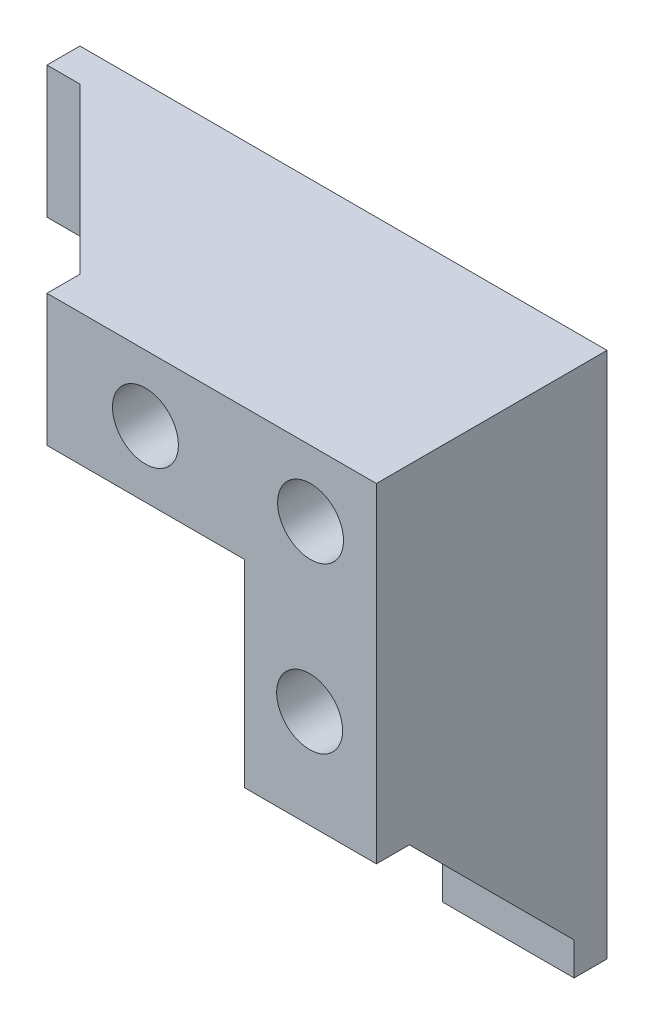
ISO-10303-21;
HEADER;
FILE_DESCRIPTION(('STEP AP214'),'2;1');
FILE_NAME('part.step','',(''),(''),'','','');
FILE_SCHEMA(('AUTOMOTIVE_DESIGN { 1 0 10303 214 1 1 1 1 }'));
ENDSEC;
DATA;
#1=APPLICATION_CONTEXT('core data for automotive mechanical design processes');
#2=APPLICATION_PROTOCOL_DEFINITION('international standard','automotive_design',2000,#1);
#3=PRODUCT_CONTEXT('',#1,'mechanical');
#4=PRODUCT('Part','Part','',(#3));
#5=PRODUCT_RELATED_PRODUCT_CATEGORY('part','',(#4));
#6=PRODUCT_DEFINITION_FORMATION('','',#4);
#7=PRODUCT_DEFINITION_CONTEXT('part definition',#1,'design');
#8=PRODUCT_DEFINITION('design','',#6,#7);
#9=PRODUCT_DEFINITION_SHAPE('','',#8);
#10=(LENGTH_UNIT() NAMED_UNIT(*) SI_UNIT(.MILLI.,.METRE.));
#11=(NAMED_UNIT(*) PLANE_ANGLE_UNIT() SI_UNIT($,.RADIAN.));
#12=(NAMED_UNIT(*) SI_UNIT($,.STERADIAN.) SOLID_ANGLE_UNIT());
#13=UNCERTAINTY_MEASURE_WITH_UNIT(LENGTH_MEASURE(1.E-05),#10,'distance_accuracy_value','');
#14=(GEOMETRIC_REPRESENTATION_CONTEXT(3) GLOBAL_UNCERTAINTY_ASSIGNED_CONTEXT((#13)) GLOBAL_UNIT_ASSIGNED_CONTEXT((#10,
#11,#12)) REPRESENTATION_CONTEXT('',''));
#15=CARTESIAN_POINT('',(0.,0.,0.));
#16=DIRECTION('',(0.,0.,1.));
#17=DIRECTION('',(1.,0.,0.));
#18=AXIS2_PLACEMENT_3D('',#15,#16,#17);
#19=CARTESIAN_POINT('',(29.3793103448276,-37.0344827586207,35.));
#20=DIRECTION('',(1.,0.,0.));
#21=DIRECTION('',(0.,1.,0.));
#22=AXIS2_PLACEMENT_3D('',#19,#20,#21);
#23=PLANE('',#22);
#24=DIRECTION('',(0.,-1.,0.));
#25=VECTOR('',#24,1.);
#26=CARTESIAN_POINT('',(29.3793103448276,-37.0344827586207,4.99999999999999));
#27=LINE('',#26,#25);
#28=CARTESIAN_POINT('',(29.3793103448276,-32.0344827586207,4.99999999999999));
#29=VERTEX_POINT('',#28);
#30=CARTESIAN_POINT('',(29.3793103448276,-37.0344827586207,5.));
#31=VERTEX_POINT('',#30);
#32=EDGE_CURVE('E181',#29,#31,#27,.T.);
#33=ORIENTED_EDGE('',*,*,#32,.F.);
#34=DIRECTION('',(0.,0.707106781186547,0.707106781186548));
#35=VECTOR('',#34,1.);
#36=CARTESIAN_POINT('',(29.3793103448276,-19.5344827586207,17.5));
#37=LINE('',#36,#35);
#38=CARTESIAN_POINT('',(29.3793103448276,-7.0344827586207,30.));
#39=VERTEX_POINT('',#38);
#40=EDGE_CURVE('E175',#29,#39,#37,.T.);
#41=ORIENTED_EDGE('',*,*,#40,.T.);
#42=DIRECTION('',(0.,0.,1.));
#43=VECTOR('',#42,1.);
#44=CARTESIAN_POINT('',(29.3793103448276,-7.0344827586207,35.));
#45=LINE('',#44,#43);
#46=CARTESIAN_POINT('',(29.3793103448276,-7.0344827586207,35.));
#47=VERTEX_POINT('',#46);
#48=EDGE_CURVE('E178',#39,#47,#45,.T.);
#49=ORIENTED_EDGE('',*,*,#48,.T.);
#50=DIRECTION('',(0.,-1.,0.));
#51=VECTOR('',#50,1.);
#52=CARTESIAN_POINT('',(29.3793103448276,-37.0344827586207,35.));
#53=LINE('',#52,#51);
#54=CARTESIAN_POINT('',(29.3793103448276,22.9655172413793,35.));
#55=VERTEX_POINT('',#54);
#56=EDGE_CURVE('E240',#55,#47,#53,.T.);
#57=ORIENTED_EDGE('',*,*,#56,.F.);
#58=DIRECTION('',(0.,0.,-1.));
#59=VECTOR('',#58,1.);
#60=CARTESIAN_POINT('',(29.3793103448276,22.9655172413793,35.));
#61=LINE('',#60,#59);
#62=CARTESIAN_POINT('',(29.3793103448276,22.9655172413793,0.));
#63=VERTEX_POINT('',#62);
#64=EDGE_CURVE('E43',#55,#63,#61,.T.);
#65=ORIENTED_EDGE('',*,*,#64,.T.);
#66=DIRECTION('',(0.,-1.,0.));
#67=VECTOR('',#66,1.);
#68=CARTESIAN_POINT('',(29.3793103448276,-37.0344827586207,0.));
#69=LINE('',#68,#67);
#70=CARTESIAN_POINT('',(29.3793103448276,-37.0344827586207,0.));
#71=VERTEX_POINT('',#70);
#72=EDGE_CURVE('E253',#63,#71,#69,.T.);
#73=ORIENTED_EDGE('',*,*,#72,.T.);
#74=DIRECTION('',(0.,0.,-1.));
#75=VECTOR('',#74,1.);
#76=CARTESIAN_POINT('',(29.3793103448276,-37.0344827586207,35.));
#77=LINE('',#76,#75);
#78=EDGE_CURVE('E269',#31,#71,#77,.T.);
#79=ORIENTED_EDGE('',*,*,#78,.F.);
#80=EDGE_LOOP('',(#33,#41,#49,#57,#65,#73,#79));
#81=FACE_BOUND('',#80,.T.);
#82=ADVANCED_FACE('F34',(#81),#23,.F.);
#83=CARTESIAN_POINT('',(49.3793103448276,-37.0344827586207,35.));
#84=DIRECTION('',(0.,1.,0.));
#85=DIRECTION('',(0.,0.,1.));
#86=AXIS2_PLACEMENT_3D('',#83,#84,#85);
#87=PLANE('',#86);
#88=DIRECTION('',(1.,0.,0.));
#89=VECTOR('',#88,1.);
#90=CARTESIAN_POINT('',(14.3793103448276,-37.0344827586207,5.));
#91=LINE('',#90,#89);
#92=CARTESIAN_POINT('',(49.3793103448276,-37.0344827586207,5.));
#93=VERTEX_POINT('',#92);
#94=EDGE_CURVE('E167',#31,#93,#91,.T.);
#95=ORIENTED_EDGE('',*,*,#94,.F.);
#96=ORIENTED_EDGE('',*,*,#78,.T.);
#97=DIRECTION('',(1.,0.,0.));
#98=VECTOR('',#97,1.);
#99=CARTESIAN_POINT('',(49.3793103448276,-37.0344827586207,0.));
#100=LINE('',#99,#98);
#101=CARTESIAN_POINT('',(49.3793103448276,-37.0344827586207,0.));
#102=VERTEX_POINT('',#101);
#103=EDGE_CURVE('E256',#71,#102,#100,.T.);
#104=ORIENTED_EDGE('',*,*,#103,.T.);
#105=DIRECTION('',(0.,0.,-1.));
#106=VECTOR('',#105,1.);
#107=CARTESIAN_POINT('',(49.3793103448276,-37.0344827586207,35.));
#108=LINE('',#107,#106);
#109=EDGE_CURVE('E267',#93,#102,#108,.T.);
#110=ORIENTED_EDGE('',*,*,#109,.F.);
#111=EDGE_LOOP('',(#95,#96,#104,#110));
#112=FACE_BOUND('',#111,.T.);
#113=ADVANCED_FACE('F303',(#112),#87,.F.);
#114=CARTESIAN_POINT('',(49.3793103448276,42.9655172413793,35.));
#115=DIRECTION('',(-1.,0.,0.));
#116=DIRECTION('',(0.,0.,1.));
#117=AXIS2_PLACEMENT_3D('',#114,#115,#116);
#118=PLANE('',#117);
#119=DIRECTION('',(0.,-1.,0.));
#120=VECTOR('',#119,1.);
#121=CARTESIAN_POINT('',(49.3793103448276,0.,5.));
#122=LINE('',#121,#120);
#123=CARTESIAN_POINT('',(49.3793103448276,-32.0344827586207,4.99999999999999));
#124=VERTEX_POINT('',#123);
#125=EDGE_CURVE('E159',#124,#93,#122,.T.);
#126=ORIENTED_EDGE('',*,*,#125,.T.);
#127=ORIENTED_EDGE('',*,*,#109,.T.);
#128=DIRECTION('',(0.,1.,0.));
#129=VECTOR('',#128,1.);
#130=CARTESIAN_POINT('',(49.3793103448276,42.9655172413793,0.));
#131=LINE('',#130,#129);
#132=CARTESIAN_POINT('',(49.3793103448276,42.9655172413793,0.));
#133=VERTEX_POINT('',#132);
#134=EDGE_CURVE('E259',#102,#133,#131,.T.);
#135=ORIENTED_EDGE('',*,*,#134,.T.);
#136=DIRECTION('',(0.,0.,-1.));
#137=VECTOR('',#136,1.);
#138=CARTESIAN_POINT('',(49.3793103448276,42.9655172413793,35.));
#139=LINE('',#138,#137);
#140=CARTESIAN_POINT('',(49.3793103448276,42.9655172413793,35.));
#141=VERTEX_POINT('',#140);
#142=EDGE_CURVE('E264',#141,#133,#139,.T.);
#143=ORIENTED_EDGE('',*,*,#142,.F.);
#144=DIRECTION('',(0.,1.,0.));
#145=VECTOR('',#144,1.);
#146=CARTESIAN_POINT('',(49.3793103448276,42.9655172413793,35.));
#147=LINE('',#146,#145);
#148=CARTESIAN_POINT('',(49.3793103448276,-7.0344827586207,35.));
#149=VERTEX_POINT('',#148);
#150=EDGE_CURVE('E244',#149,#141,#147,.T.);
#151=ORIENTED_EDGE('',*,*,#150,.F.);
#152=DIRECTION('',(0.,0.,1.));
#153=VECTOR('',#152,1.);
#154=CARTESIAN_POINT('',(49.3793103448276,-7.0344827586207,0.));
#155=LINE('',#154,#153);
#156=CARTESIAN_POINT('',(49.3793103448276,-7.0344827586207,30.));
#157=VERTEX_POINT('',#156);
#158=EDGE_CURVE('E59',#157,#149,#155,.T.);
#159=ORIENTED_EDGE('',*,*,#158,.F.);
#160=DIRECTION('',(0.,0.707106781186547,0.707106781186548));
#161=VECTOR('',#160,1.);
#162=CARTESIAN_POINT('',(49.3793103448276,-18.5172413793104,18.5172413793103));
#163=LINE('',#162,#161);
#164=EDGE_CURVE('E162',#124,#157,#163,.T.);
#165=ORIENTED_EDGE('',*,*,#164,.F.);
#166=EDGE_LOOP('',(#126,#127,#135,#143,#151,#159,#165));
#167=FACE_BOUND('',#166,.T.);
#168=ADVANCED_FACE('F294',(#167),#118,.F.);
#169=CARTESIAN_POINT('',(-30.6206896551724,22.9655172413793,35.));
#170=DIRECTION('',(1.,0.,0.));
#171=DIRECTION('',(0.,1.,0.));
#172=AXIS2_PLACEMENT_3D('',#169,#170,#171);
#173=PLANE('',#172);
#174=DIRECTION('',(0.,0.,-1.));
#175=VECTOR('',#174,1.);
#176=CARTESIAN_POINT('',(-30.6206896551724,22.9655172413793,35.));
#177=LINE('',#176,#175);
#178=CARTESIAN_POINT('',(-30.6206896551724,22.9655172413793,5.00000000000001));
#179=VERTEX_POINT('',#178);
#180=CARTESIAN_POINT('',(-30.6206896551724,22.9655172413793,0.));
#181=VERTEX_POINT('',#180);
#182=EDGE_CURVE('E11',#179,#181,#177,.T.);
#183=ORIENTED_EDGE('',*,*,#182,.F.);
#184=DIRECTION('',(0.,1.,0.));
#185=VECTOR('',#184,1.);
#186=CARTESIAN_POINT('',(-30.6206896551724,7.9655172413793,5.00000000000001));
#187=LINE('',#186,#185);
#188=CARTESIAN_POINT('',(-30.6206896551724,42.9655172413793,5.00000000000001));
#189=VERTEX_POINT('',#188);
#190=EDGE_CURVE('E150',#179,#189,#187,.T.);
#191=ORIENTED_EDGE('',*,*,#190,.T.);
#192=DIRECTION('',(0.,0.,-1.));
#193=VECTOR('',#192,1.);
#194=CARTESIAN_POINT('',(-30.6206896551724,42.9655172413793,35.));
#195=LINE('',#194,#193);
#196=CARTESIAN_POINT('',(-30.6206896551724,42.9655172413793,0.));
#197=VERTEX_POINT('',#196);
#198=EDGE_CURVE('E248',#189,#197,#195,.T.);
#199=ORIENTED_EDGE('',*,*,#198,.T.);
#200=DIRECTION('',(0.,-1.,0.));
#201=VECTOR('',#200,1.);
#202=CARTESIAN_POINT('',(-30.6206896551724,22.9655172413793,0.));
#203=LINE('',#202,#201);
#204=EDGE_CURVE('E237',#197,#181,#203,.T.);
#205=ORIENTED_EDGE('',*,*,#204,.T.);
#206=EDGE_LOOP('',(#183,#191,#199,#205));
#207=FACE_BOUND('',#206,.T.);
#208=ADVANCED_FACE('F36',(#207),#173,.F.);
#209=CARTESIAN_POINT('',(29.3793103448276,22.9655172413793,35.));
#210=DIRECTION('',(0.,1.,0.));
#211=DIRECTION('',(-1.,0.,0.));
#212=AXIS2_PLACEMENT_3D('',#209,#210,#211);
#213=PLANE('',#212);
#214=DIRECTION('',(1.,0.,0.));
#215=VECTOR('',#214,1.);
#216=CARTESIAN_POINT('',(29.3793103448276,22.9655172413793,35.));
#217=LINE('',#216,#215);
#218=CARTESIAN_POINT('',(-0.620689655172424,22.9655172413793,35.));
#219=VERTEX_POINT('',#218);
#220=EDGE_CURVE('E238',#219,#55,#217,.T.);
#221=ORIENTED_EDGE('',*,*,#220,.F.);
#222=DIRECTION('',(0.,0.,-1.));
#223=VECTOR('',#222,1.);
#224=CARTESIAN_POINT('',(-0.620689655172424,22.9655172413793,35.));
#225=LINE('',#224,#223);
#226=CARTESIAN_POINT('',(-0.620689655172424,22.9655172413793,30.));
#227=VERTEX_POINT('',#226);
#228=EDGE_CURVE('E51',#219,#227,#225,.T.);
#229=ORIENTED_EDGE('',*,*,#228,.T.);
#230=DIRECTION('',(-0.707106781186548,0.,-0.707106781186548));
#231=VECTOR('',#230,1.);
#232=CARTESIAN_POINT('',(16.8793103448276,22.9655172413793,47.5));
#233=LINE('',#232,#231);
#234=CARTESIAN_POINT('',(-25.6206896551724,22.9655172413793,5.00000000000001));
#235=VERTEX_POINT('',#234);
#236=EDGE_CURVE('E132',#227,#235,#233,.T.);
#237=ORIENTED_EDGE('',*,*,#236,.T.);
#238=DIRECTION('',(-1.,0.,0.));
#239=VECTOR('',#238,1.);
#240=CARTESIAN_POINT('',(29.3793103448276,22.9655172413793,5.));
#241=LINE('',#240,#239);
#242=EDGE_CURVE('E156',#235,#179,#241,.T.);
#243=ORIENTED_EDGE('',*,*,#242,.T.);
#244=ORIENTED_EDGE('',*,*,#182,.T.);
#245=DIRECTION('',(1.,0.,0.));
#246=VECTOR('',#245,1.);
#247=CARTESIAN_POINT('',(29.3793103448276,22.9655172413793,0.));
#248=LINE('',#247,#246);
#249=EDGE_CURVE('E251',#181,#63,#248,.T.);
#250=ORIENTED_EDGE('',*,*,#249,.T.);
#251=ORIENTED_EDGE('',*,*,#64,.F.);
#252=EDGE_LOOP('',(#221,#229,#237,#243,#244,#250,#251));
#253=FACE_BOUND('',#252,.T.);
#254=ADVANCED_FACE('F317',(#253),#213,.F.);
#255=CARTESIAN_POINT('',(-30.6206896551724,42.9655172413793,35.));
#256=DIRECTION('',(0.,-1.,0.));
#257=DIRECTION('',(0.,0.,-1.));
#258=AXIS2_PLACEMENT_3D('',#255,#256,#257);
#259=PLANE('',#258);
#260=DIRECTION('',(-0.707106781186548,0.,-0.707106781186548));
#261=VECTOR('',#260,1.);
#262=CARTESIAN_POINT('',(-15.3103448275862,42.9655172413793,15.3103448275862));
#263=LINE('',#262,#261);
#264=CARTESIAN_POINT('',(-0.620689655172424,42.9655172413793,30.));
#265=VERTEX_POINT('',#264);
#266=CARTESIAN_POINT('',(-25.6206896551724,42.9655172413793,5.00000000000001));
#267=VERTEX_POINT('',#266);
#268=EDGE_CURVE('E129',#265,#267,#263,.T.);
#269=ORIENTED_EDGE('',*,*,#268,.F.);
#270=DIRECTION('',(0.,0.,-1.));
#271=VECTOR('',#270,1.);
#272=CARTESIAN_POINT('',(-0.620689655172424,42.9655172413793,0.));
#273=LINE('',#272,#271);
#274=CARTESIAN_POINT('',(-0.620689655172424,42.9655172413793,35.));
#275=VERTEX_POINT('',#274);
#276=EDGE_CURVE('E137',#275,#265,#273,.T.);
#277=ORIENTED_EDGE('',*,*,#276,.F.);
#278=DIRECTION('',(-1.,0.,0.));
#279=VECTOR('',#278,1.);
#280=CARTESIAN_POINT('',(-30.6206896551724,42.9655172413793,35.));
#281=LINE('',#280,#279);
#282=EDGE_CURVE('E246',#141,#275,#281,.T.);
#283=ORIENTED_EDGE('',*,*,#282,.F.);
#284=ORIENTED_EDGE('',*,*,#142,.T.);
#285=DIRECTION('',(-1.,0.,0.));
#286=VECTOR('',#285,1.);
#287=CARTESIAN_POINT('',(-30.6206896551724,42.9655172413793,0.));
#288=LINE('',#287,#286);
#289=EDGE_CURVE('E241',#133,#197,#288,.T.);
#290=ORIENTED_EDGE('',*,*,#289,.T.);
#291=ORIENTED_EDGE('',*,*,#198,.F.);
#292=DIRECTION('',(-1.,0.,0.));
#293=VECTOR('',#292,1.);
#294=CARTESIAN_POINT('',(0.,42.9655172413793,5.00000000000001));
#295=LINE('',#294,#293);
#296=EDGE_CURVE('E134',#267,#189,#295,.T.);
#297=ORIENTED_EDGE('',*,*,#296,.F.);
#298=EDGE_LOOP('',(#269,#277,#283,#284,#290,#291,#297));
#299=FACE_BOUND('',#298,.T.);
#300=ADVANCED_FACE('F144',(#299),#259,.F.);
#301=CARTESIAN_POINT('',(0.,0.,35.));
#302=DIRECTION('',(0.,0.,-1.));
#303=DIRECTION('',(-1.,0.,0.));
#304=AXIS2_PLACEMENT_3D('',#301,#302,#303);
#305=PLANE('',#304);
#306=CARTESIAN_POINT('',(39.2425898923747,7.9166773317354,35.));
#307=DIRECTION('',(0.,0.,1.));
#308=DIRECTION('',(1.,0.,0.));
#309=AXIS2_PLACEMENT_3D('',#306,#307,#308);
#310=CIRCLE('',#309,5.);
#311=CARTESIAN_POINT('',(44.2425898923747,7.9166773317354,35.));
#312=VERTEX_POINT('',#311);
#313=EDGE_CURVE('E212',#312,#312,#310,.T.);
#314=ORIENTED_EDGE('',*,*,#313,.F.);
#315=EDGE_LOOP('',(#314));
#316=FACE_BOUND('',#315,.T.);
#317=CARTESIAN_POINT('',(14.3244220159602,32.9855246861968,35.));
#318=DIRECTION('',(0.,0.,1.));
#319=DIRECTION('',(1.,0.,0.));
#320=AXIS2_PLACEMENT_3D('',#317,#318,#319);
#321=CIRCLE('',#320,5.);
#322=CARTESIAN_POINT('',(19.3244220159602,32.9855246861968,35.));
#323=VERTEX_POINT('',#322);
#324=EDGE_CURVE('E211',#323,#323,#321,.T.);
#325=ORIENTED_EDGE('',*,*,#324,.F.);
#326=EDGE_LOOP('',(#325));
#327=FACE_BOUND('',#326,.T.);
#328=CARTESIAN_POINT('',(39.3793103448276,32.9655172413793,35.));
#329=DIRECTION('',(0.,0.,1.));
#330=DIRECTION('',(1.,0.,0.));
#331=AXIS2_PLACEMENT_3D('',#328,#329,#330);
#332=CIRCLE('',#331,5.00000000000001);
#333=CARTESIAN_POINT('',(44.3793103448276,32.9655172413793,35.));
#334=VERTEX_POINT('',#333);
#335=EDGE_CURVE('E223',#334,#334,#332,.T.);
#336=ORIENTED_EDGE('',*,*,#335,.F.);
#337=EDGE_LOOP('',(#336));
#338=FACE_BOUND('',#337,.T.);
#339=ORIENTED_EDGE('',*,*,#282,.T.);
#340=DIRECTION('',(0.,1.,0.));
#341=VECTOR('',#340,1.);
#342=CARTESIAN_POINT('',(-0.620689655172424,7.9655172413793,35.));
#343=LINE('',#342,#341);
#344=EDGE_CURVE('E139',#219,#275,#343,.T.);
#345=ORIENTED_EDGE('',*,*,#344,.F.);
#346=ORIENTED_EDGE('',*,*,#220,.T.);
#347=ORIENTED_EDGE('',*,*,#56,.T.);
#348=DIRECTION('',(1.,0.,0.));
#349=VECTOR('',#348,1.);
#350=CARTESIAN_POINT('',(14.3793103448276,-7.0344827586207,35.));
#351=LINE('',#350,#349);
#352=EDGE_CURVE('E170',#47,#149,#351,.T.);
#353=ORIENTED_EDGE('',*,*,#352,.T.);
#354=ORIENTED_EDGE('',*,*,#150,.T.);
#355=EDGE_LOOP('',(#339,#345,#346,#347,#353,#354));
#356=FACE_BOUND('',#355,.T.);
#357=ADVANCED_FACE('F298',(#316,#327,#338,#356),#305,.F.);
#358=CARTESIAN_POINT('',(0.,0.,0.));
#359=DIRECTION('',(0.,0.,-1.));
#360=DIRECTION('',(-1.,0.,0.));
#361=AXIS2_PLACEMENT_3D('',#358,#359,#360);
#362=PLANE('',#361);
#363=CARTESIAN_POINT('',(-10.6413837751518,32.9855246861968,0.));
#364=DIRECTION('',(0.,0.,1.));
#365=DIRECTION('',(1.,0.,0.));
#366=AXIS2_PLACEMENT_3D('',#363,#364,#365);
#367=CIRCLE('',#366,2.75);
#368=CARTESIAN_POINT('',(-7.89138377515178,32.9855246861968,0.));
#369=VERTEX_POINT('',#368);
#370=EDGE_CURVE('E183',#369,#369,#367,.T.);
#371=ORIENTED_EDGE('',*,*,#370,.T.);
#372=EDGE_LOOP('',(#371));
#373=FACE_BOUND('',#372,.T.);
#374=CARTESIAN_POINT('',(39.2425898923747,-17.0412614318991,0.));
#375=DIRECTION('',(0.,0.,1.));
#376=DIRECTION('',(1.,0.,0.));
#377=AXIS2_PLACEMENT_3D('',#374,#375,#376);
#378=CIRCLE('',#377,2.75);
#379=CARTESIAN_POINT('',(41.9925898923747,-17.0412614318991,0.));
#380=VERTEX_POINT('',#379);
#381=EDGE_CURVE('E188',#380,#380,#378,.T.);
#382=ORIENTED_EDGE('',*,*,#381,.T.);
#383=EDGE_LOOP('',(#382));
#384=FACE_BOUND('',#383,.T.);
#385=CARTESIAN_POINT('',(39.2425898923747,7.9166773317354,0.));
#386=DIRECTION('',(0.,0.,1.));
#387=DIRECTION('',(1.,0.,0.));
#388=AXIS2_PLACEMENT_3D('',#385,#386,#387);
#389=CIRCLE('',#388,2.86119215542762);
#390=CARTESIAN_POINT('',(42.1037820478023,7.9166773317354,0.));
#391=VERTEX_POINT('',#390);
#392=EDGE_CURVE('E184',#391,#391,#389,.T.);
#393=ORIENTED_EDGE('',*,*,#392,.T.);
#394=EDGE_LOOP('',(#393));
#395=FACE_BOUND('',#394,.T.);
#396=CARTESIAN_POINT('',(14.3244220159602,32.9855246861968,0.));
#397=DIRECTION('',(0.,0.,1.));
#398=DIRECTION('',(1.,0.,0.));
#399=AXIS2_PLACEMENT_3D('',#396,#397,#398);
#400=CIRCLE('',#399,2.75);
#401=CARTESIAN_POINT('',(17.0744220159602,32.9855246861968,0.));
#402=VERTEX_POINT('',#401);
#403=EDGE_CURVE('E187',#402,#402,#400,.T.);
#404=ORIENTED_EDGE('',*,*,#403,.T.);
#405=EDGE_LOOP('',(#404));
#406=FACE_BOUND('',#405,.T.);
#407=CARTESIAN_POINT('',(39.3793103448276,32.9655172413793,0.));
#408=DIRECTION('',(0.,0.,1.));
#409=DIRECTION('',(1.,0.,0.));
#410=AXIS2_PLACEMENT_3D('',#407,#408,#409);
#411=CIRCLE('',#410,2.75000000000001);
#412=CARTESIAN_POINT('',(42.1293103448276,32.9655172413793,0.));
#413=VERTEX_POINT('',#412);
#414=EDGE_CURVE('E234',#413,#413,#411,.T.);
#415=ORIENTED_EDGE('',*,*,#414,.T.);
#416=EDGE_LOOP('',(#415));
#417=FACE_BOUND('',#416,.T.);
#418=ORIENTED_EDGE('',*,*,#204,.F.);
#419=ORIENTED_EDGE('',*,*,#289,.F.);
#420=ORIENTED_EDGE('',*,*,#134,.F.);
#421=ORIENTED_EDGE('',*,*,#103,.F.);
#422=ORIENTED_EDGE('',*,*,#72,.F.);
#423=ORIENTED_EDGE('',*,*,#249,.F.);
#424=EDGE_LOOP('',(#418,#419,#420,#421,#422,#423));
#425=FACE_BOUND('',#424,.T.);
#426=ADVANCED_FACE('F309',(#373,#384,#395,#406,#417,#425),#362,.T.);
#427=CARTESIAN_POINT('',(39.3793103448276,32.9655172413793,35.));
#428=DIRECTION('',(0.,0.,1.));
#429=DIRECTION('',(1.,0.,0.));
#430=AXIS2_PLACEMENT_3D('',#427,#428,#429);
#431=CYLINDRICAL_SURFACE('',#430,2.75000000000001);
#432=ORIENTED_EDGE('',*,*,#414,.F.);
#433=EDGE_LOOP('',(#432));
#434=FACE_BOUND('',#433,.T.);
#435=CARTESIAN_POINT('',(39.3793103448276,32.9655172413793,8.));
#436=DIRECTION('',(0.,0.,1.));
#437=DIRECTION('',(1.,0.,0.));
#438=AXIS2_PLACEMENT_3D('',#435,#436,#437);
#439=CIRCLE('',#438,2.75000000000001);
#440=CARTESIAN_POINT('',(42.1293103448276,32.9655172413793,8.));
#441=VERTEX_POINT('',#440);
#442=EDGE_CURVE('E231',#441,#441,#439,.T.);
#443=ORIENTED_EDGE('',*,*,#442,.T.);
#444=EDGE_LOOP('',(#443));
#445=FACE_BOUND('',#444,.T.);
#446=ADVANCED_FACE('F336',(#434,#445),#431,.F.);
#447=CARTESIAN_POINT('',(42.1293103448276,32.9655172413793,8.));
#448=DIRECTION('',(0.,0.,-1.));
#449=DIRECTION('',(-1.,0.,0.));
#450=AXIS2_PLACEMENT_3D('',#447,#448,#449);
#451=PLANE('',#450);
#452=ORIENTED_EDGE('',*,*,#442,.F.);
#453=EDGE_LOOP('',(#452));
#454=FACE_BOUND('',#453,.T.);
#455=CARTESIAN_POINT('',(39.3793103448276,32.9655172413793,8.));
#456=DIRECTION('',(0.,0.,1.));
#457=DIRECTION('',(1.,0.,0.));
#458=AXIS2_PLACEMENT_3D('',#455,#456,#457);
#459=CIRCLE('',#458,5.00000000000001);
#460=CARTESIAN_POINT('',(44.3793103448276,32.9655172413793,8.));
#461=VERTEX_POINT('',#460);
#462=EDGE_CURVE('E228',#461,#461,#459,.T.);
#463=ORIENTED_EDGE('',*,*,#462,.T.);
#464=EDGE_LOOP('',(#463));
#465=FACE_BOUND('',#464,.T.);
#466=ADVANCED_FACE('F343',(#454,#465),#451,.F.);
#467=CARTESIAN_POINT('',(39.3793103448276,32.9655172413793,35.));
#468=DIRECTION('',(0.,0.,1.));
#469=DIRECTION('',(1.,0.,0.));
#470=AXIS2_PLACEMENT_3D('',#467,#468,#469);
#471=CYLINDRICAL_SURFACE('',#470,5.00000000000001);
#472=ORIENTED_EDGE('',*,*,#462,.F.);
#473=EDGE_LOOP('',(#472));
#474=FACE_BOUND('',#473,.T.);
#475=ORIENTED_EDGE('',*,*,#335,.T.);
#476=EDGE_LOOP('',(#475));
#477=FACE_BOUND('',#476,.T.);
#478=ADVANCED_FACE('F347',(#474,#477),#471,.F.);
#479=CARTESIAN_POINT('',(14.3244220159602,32.9855246861968,8.));
#480=DIRECTION('',(0.,0.,1.));
#481=DIRECTION('',(1.,0.,0.));
#482=AXIS2_PLACEMENT_3D('',#479,#480,#481);
#483=CYLINDRICAL_SURFACE('',#482,5.);
#484=CARTESIAN_POINT('',(14.3244220159602,32.9855246861968,8.));
#485=DIRECTION('',(0.,0.,1.));
#486=DIRECTION('',(1.,0.,0.));
#487=AXIS2_PLACEMENT_3D('',#484,#485,#486);
#488=CIRCLE('',#487,5.);
#489=CARTESIAN_POINT('',(19.3244220159602,32.9855246861968,8.));
#490=VERTEX_POINT('',#489);
#491=EDGE_CURVE('E220',#490,#490,#488,.T.);
#492=ORIENTED_EDGE('',*,*,#491,.F.);
#493=EDGE_LOOP('',(#492));
#494=FACE_BOUND('',#493,.T.);
#495=ORIENTED_EDGE('',*,*,#324,.T.);
#496=EDGE_LOOP('',(#495));
#497=FACE_BOUND('',#496,.T.);
#498=ADVANCED_FACE('F351',(#494,#497),#483,.F.);
#499=CARTESIAN_POINT('',(14.3244220159602,32.9855246861968,8.));
#500=DIRECTION('',(0.,0.,1.));
#501=DIRECTION('',(1.,0.,0.));
#502=AXIS2_PLACEMENT_3D('',#499,#500,#501);
#503=PLANE('',#502);
#504=CARTESIAN_POINT('',(14.3244220159602,32.9855246861968,8.));
#505=DIRECTION('',(0.,0.,1.));
#506=DIRECTION('',(1.,0.,0.));
#507=AXIS2_PLACEMENT_3D('',#504,#505,#506);
#508=CIRCLE('',#507,2.75);
#509=CARTESIAN_POINT('',(17.0744220159602,32.9855246861968,8.));
#510=VERTEX_POINT('',#509);
#511=EDGE_CURVE('E204',#510,#510,#508,.T.);
#512=ORIENTED_EDGE('',*,*,#511,.F.);
#513=EDGE_LOOP('',(#512));
#514=FACE_BOUND('',#513,.T.);
#515=ORIENTED_EDGE('',*,*,#491,.T.);
#516=EDGE_LOOP('',(#515));
#517=FACE_BOUND('',#516,.T.);
#518=ADVANCED_FACE('F355',(#514,#517),#503,.T.);
#519=CARTESIAN_POINT('',(39.2425898923747,7.9166773317354,8.));
#520=DIRECTION('',(0.,0.,1.));
#521=DIRECTION('',(1.,0.,0.));
#522=AXIS2_PLACEMENT_3D('',#519,#520,#521);
#523=CYLINDRICAL_SURFACE('',#522,5.);
#524=CARTESIAN_POINT('',(39.2425898923747,7.9166773317354,8.));
#525=DIRECTION('',(0.,0.,1.));
#526=DIRECTION('',(1.,0.,0.));
#527=AXIS2_PLACEMENT_3D('',#524,#525,#526);
#528=CIRCLE('',#527,5.);
#529=CARTESIAN_POINT('',(44.2425898923747,7.9166773317354,8.));
#530=VERTEX_POINT('',#529);
#531=EDGE_CURVE('E208',#530,#530,#528,.T.);
#532=ORIENTED_EDGE('',*,*,#531,.F.);
#533=EDGE_LOOP('',(#532));
#534=FACE_BOUND('',#533,.T.);
#535=ORIENTED_EDGE('',*,*,#313,.T.);
#536=EDGE_LOOP('',(#535));
#537=FACE_BOUND('',#536,.T.);
#538=ADVANCED_FACE('F359',(#534,#537),#523,.F.);
#539=CARTESIAN_POINT('',(39.2425898923747,7.9166773317354,8.));
#540=DIRECTION('',(0.,0.,1.));
#541=DIRECTION('',(1.,0.,0.));
#542=AXIS2_PLACEMENT_3D('',#539,#540,#541);
#543=PLANE('',#542);
#544=CARTESIAN_POINT('',(39.2425898923747,7.9166773317354,8.));
#545=DIRECTION('',(0.,0.,1.));
#546=DIRECTION('',(1.,0.,0.));
#547=AXIS2_PLACEMENT_3D('',#544,#545,#546);
#548=CIRCLE('',#547,2.86119215542762);
#549=CARTESIAN_POINT('',(42.1037820478023,7.9166773317354,8.));
#550=VERTEX_POINT('',#549);
#551=EDGE_CURVE('E201',#550,#550,#548,.T.);
#552=ORIENTED_EDGE('',*,*,#551,.F.);
#553=EDGE_LOOP('',(#552));
#554=FACE_BOUND('',#553,.T.);
#555=ORIENTED_EDGE('',*,*,#531,.T.);
#556=EDGE_LOOP('',(#555));
#557=FACE_BOUND('',#556,.T.);
#558=ADVANCED_FACE('F373',(#554,#557),#543,.T.);
#559=CARTESIAN_POINT('',(39.2425898923747,-17.0412614318991,8.));
#560=DIRECTION('',(0.,0.,1.));
#561=DIRECTION('',(1.,0.,0.));
#562=AXIS2_PLACEMENT_3D('',#559,#560,#561);
#563=CYLINDRICAL_SURFACE('',#562,5.);
#564=CARTESIAN_POINT('',(39.2425898923747,-17.0412614318991,19.9932213267216));
#565=DIRECTION('',(0.,0.707106781186548,-0.707106781186547));
#566=DIRECTION('',(0.,0.707106781186547,0.707106781186548));
#567=AXIS2_PLACEMENT_3D('',#564,#565,#566);
#568=ELLIPSE('',#567,7.07106781186547,5.);
#569=CARTESIAN_POINT('',(39.2425898923747,-12.0412614318991,24.9932213267216));
#570=VERTEX_POINT('',#569);
#571=EDGE_CURVE('E169',#570,#570,#568,.F.);
#572=ORIENTED_EDGE('',*,*,#571,.T.);
#573=EDGE_LOOP('',(#572));
#574=FACE_BOUND('',#573,.T.);
#575=CARTESIAN_POINT('',(39.2425898923747,-17.0412614318991,8.));
#576=DIRECTION('',(0.,0.,1.));
#577=DIRECTION('',(1.,0.,0.));
#578=AXIS2_PLACEMENT_3D('',#575,#576,#577);
#579=CIRCLE('',#578,5.);
#580=CARTESIAN_POINT('',(44.2425898923747,-17.0412614318991,8.));
#581=VERTEX_POINT('',#580);
#582=EDGE_CURVE('E215',#581,#581,#579,.T.);
#583=ORIENTED_EDGE('',*,*,#582,.F.);
#584=EDGE_LOOP('',(#583));
#585=FACE_BOUND('',#584,.T.);
#586=ADVANCED_FACE('F275',(#574,#585),#563,.F.);
#587=CARTESIAN_POINT('',(39.2425898923747,-17.0412614318991,8.));
#588=DIRECTION('',(0.,0.,1.));
#589=DIRECTION('',(1.,0.,0.));
#590=AXIS2_PLACEMENT_3D('',#587,#588,#589);
#591=PLANE('',#590);
#592=CARTESIAN_POINT('',(39.2425898923747,-17.0412614318991,8.));
#593=DIRECTION('',(0.,0.,1.));
#594=DIRECTION('',(1.,0.,0.));
#595=AXIS2_PLACEMENT_3D('',#592,#593,#594);
#596=CIRCLE('',#595,2.75);
#597=CARTESIAN_POINT('',(41.9925898923747,-17.0412614318991,8.));
#598=VERTEX_POINT('',#597);
#599=EDGE_CURVE('E198',#598,#598,#596,.T.);
#600=ORIENTED_EDGE('',*,*,#599,.F.);
#601=EDGE_LOOP('',(#600));
#602=FACE_BOUND('',#601,.T.);
#603=ORIENTED_EDGE('',*,*,#582,.T.);
#604=EDGE_LOOP('',(#603));
#605=FACE_BOUND('',#604,.T.);
#606=ADVANCED_FACE('F365',(#602,#605),#591,.T.);
#607=CARTESIAN_POINT('',(-10.6413837751518,32.9855246861968,8.));
#608=DIRECTION('',(0.,0.,1.));
#609=DIRECTION('',(1.,0.,0.));
#610=AXIS2_PLACEMENT_3D('',#607,#608,#609);
#611=CYLINDRICAL_SURFACE('',#610,5.);
#612=CARTESIAN_POINT('',(-10.6413837751518,32.9855246861968,19.9793058800207));
#613=DIRECTION('',(0.707106781186548,0.,-0.707106781186548));
#614=DIRECTION('',(0.707106781186548,0.,0.707106781186548));
#615=AXIS2_PLACEMENT_3D('',#612,#613,#614);
#616=ELLIPSE('',#615,7.07106781186547,5.);
#617=CARTESIAN_POINT('',(-5.64138377515178,32.9855246861968,24.9793058800207));
#618=VERTEX_POINT('',#617);
#619=EDGE_CURVE('E38',#618,#618,#616,.F.);
#620=ORIENTED_EDGE('',*,*,#619,.T.);
#621=EDGE_LOOP('',(#620));
#622=FACE_BOUND('',#621,.T.);
#623=CARTESIAN_POINT('',(-10.6413837751518,32.9855246861968,8.));
#624=DIRECTION('',(0.,0.,1.));
#625=DIRECTION('',(1.,0.,0.));
#626=AXIS2_PLACEMENT_3D('',#623,#624,#625);
#627=CIRCLE('',#626,5.);
#628=CARTESIAN_POINT('',(-5.64138377515178,32.9855246861968,8.));
#629=VERTEX_POINT('',#628);
#630=EDGE_CURVE('E207',#629,#629,#627,.T.);
#631=ORIENTED_EDGE('',*,*,#630,.F.);
#632=EDGE_LOOP('',(#631));
#633=FACE_BOUND('',#632,.T.);
#634=ADVANCED_FACE('F361',(#622,#633),#611,.F.);
#635=CARTESIAN_POINT('',(-10.6413837751518,32.9855246861968,8.));
#636=DIRECTION('',(0.,0.,1.));
#637=DIRECTION('',(1.,0.,0.));
#638=AXIS2_PLACEMENT_3D('',#635,#636,#637);
#639=PLANE('',#638);
#640=CARTESIAN_POINT('',(-10.6413837751518,32.9855246861968,8.));
#641=DIRECTION('',(0.,0.,1.));
#642=DIRECTION('',(1.,0.,0.));
#643=AXIS2_PLACEMENT_3D('',#640,#641,#642);
#644=CIRCLE('',#643,2.75);
#645=CARTESIAN_POINT('',(-7.89138377515178,32.9855246861968,8.));
#646=VERTEX_POINT('',#645);
#647=EDGE_CURVE('E195',#646,#646,#644,.T.);
#648=ORIENTED_EDGE('',*,*,#647,.F.);
#649=EDGE_LOOP('',(#648));
#650=FACE_BOUND('',#649,.T.);
#651=ORIENTED_EDGE('',*,*,#630,.T.);
#652=EDGE_LOOP('',(#651));
#653=FACE_BOUND('',#652,.T.);
#654=ADVANCED_FACE('F364',(#650,#653),#639,.T.);
#655=CARTESIAN_POINT('',(-10.6413837751518,32.9855246861968,0.));
#656=DIRECTION('',(0.,0.,1.));
#657=DIRECTION('',(1.,0.,0.));
#658=AXIS2_PLACEMENT_3D('',#655,#656,#657);
#659=CYLINDRICAL_SURFACE('',#658,2.75);
#660=ORIENTED_EDGE('',*,*,#647,.T.);
#661=EDGE_LOOP('',(#660));
#662=FACE_BOUND('',#661,.T.);
#663=ORIENTED_EDGE('',*,*,#370,.F.);
#664=EDGE_LOOP('',(#663));
#665=FACE_BOUND('',#664,.T.);
#666=ADVANCED_FACE('F369',(#662,#665),#659,.F.);
#667=CARTESIAN_POINT('',(39.2425898923747,-17.0412614318991,0.));
#668=DIRECTION('',(0.,0.,1.));
#669=DIRECTION('',(1.,0.,0.));
#670=AXIS2_PLACEMENT_3D('',#667,#668,#669);
#671=CYLINDRICAL_SURFACE('',#670,2.75);
#672=ORIENTED_EDGE('',*,*,#599,.T.);
#673=EDGE_LOOP('',(#672));
#674=FACE_BOUND('',#673,.T.);
#675=ORIENTED_EDGE('',*,*,#381,.F.);
#676=EDGE_LOOP('',(#675));
#677=FACE_BOUND('',#676,.T.);
#678=ADVANCED_FACE('F390',(#674,#677),#671,.F.);
#679=CARTESIAN_POINT('',(39.2425898923747,7.9166773317354,0.));
#680=DIRECTION('',(0.,0.,1.));
#681=DIRECTION('',(1.,0.,0.));
#682=AXIS2_PLACEMENT_3D('',#679,#680,#681);
#683=CYLINDRICAL_SURFACE('',#682,2.86119215542762);
#684=ORIENTED_EDGE('',*,*,#551,.T.);
#685=EDGE_LOOP('',(#684));
#686=FACE_BOUND('',#685,.T.);
#687=ORIENTED_EDGE('',*,*,#392,.F.);
#688=EDGE_LOOP('',(#687));
#689=FACE_BOUND('',#688,.T.);
#690=ADVANCED_FACE('F386',(#686,#689),#683,.F.);
#691=CARTESIAN_POINT('',(14.3244220159602,32.9855246861968,0.));
#692=DIRECTION('',(0.,0.,1.));
#693=DIRECTION('',(1.,0.,0.));
#694=AXIS2_PLACEMENT_3D('',#691,#692,#693);
#695=CYLINDRICAL_SURFACE('',#694,2.75);
#696=ORIENTED_EDGE('',*,*,#511,.T.);
#697=EDGE_LOOP('',(#696));
#698=FACE_BOUND('',#697,.T.);
#699=ORIENTED_EDGE('',*,*,#403,.F.);
#700=EDGE_LOOP('',(#699));
#701=FACE_BOUND('',#700,.T.);
#702=ADVANCED_FACE('F383',(#698,#701),#695,.F.);
#703=CARTESIAN_POINT('',(14.3793103448276,0.,5.));
#704=DIRECTION('',(0.,0.,1.));
#705=DIRECTION('',(0.,-1.,0.));
#706=AXIS2_PLACEMENT_3D('',#703,#704,#705);
#707=PLANE('',#706);
#708=ORIENTED_EDGE('',*,*,#32,.T.);
#709=ORIENTED_EDGE('',*,*,#94,.T.);
#710=ORIENTED_EDGE('',*,*,#125,.F.);
#711=DIRECTION('',(1.,0.,0.));
#712=VECTOR('',#711,1.);
#713=CARTESIAN_POINT('',(14.3793103448276,-32.0344827586207,4.99999999999999));
#714=LINE('',#713,#712);
#715=EDGE_CURVE('E166',#29,#124,#714,.T.);
#716=ORIENTED_EDGE('',*,*,#715,.F.);
#717=EDGE_LOOP('',(#708,#709,#710,#716));
#718=FACE_BOUND('',#717,.T.);
#719=ADVANCED_FACE('F290',(#718),#707,.T.);
#720=CARTESIAN_POINT('',(14.3793103448276,-7.0344827586207,0.));
#721=DIRECTION('',(0.,1.,0.));
#722=DIRECTION('',(0.,0.,1.));
#723=AXIS2_PLACEMENT_3D('',#720,#721,#722);
#724=PLANE('',#723);
#725=DIRECTION('',(1.,0.,0.));
#726=VECTOR('',#725,1.);
#727=CARTESIAN_POINT('',(14.3793103448276,-7.0344827586207,30.));
#728=LINE('',#727,#726);
#729=EDGE_CURVE('E172',#39,#157,#728,.T.);
#730=ORIENTED_EDGE('',*,*,#729,.T.);
#731=ORIENTED_EDGE('',*,*,#158,.T.);
#732=ORIENTED_EDGE('',*,*,#352,.F.);
#733=ORIENTED_EDGE('',*,*,#48,.F.);
#734=EDGE_LOOP('',(#730,#731,#732,#733));
#735=FACE_BOUND('',#734,.T.);
#736=ADVANCED_FACE('F282',(#735),#724,.F.);
#737=CARTESIAN_POINT('',(14.3793103448276,-18.5172413793104,18.5172413793103));
#738=DIRECTION('',(0.,0.707106781186548,-0.707106781186547));
#739=DIRECTION('',(0.,0.707106781186547,0.707106781186548));
#740=AXIS2_PLACEMENT_3D('',#737,#738,#739);
#741=PLANE('',#740);
#742=ORIENTED_EDGE('',*,*,#571,.F.);
#743=EDGE_LOOP('',(#742));
#744=FACE_BOUND('',#743,.T.);
#745=ORIENTED_EDGE('',*,*,#715,.T.);
#746=ORIENTED_EDGE('',*,*,#164,.T.);
#747=ORIENTED_EDGE('',*,*,#729,.F.);
#748=ORIENTED_EDGE('',*,*,#40,.F.);
#749=EDGE_LOOP('',(#745,#746,#747,#748));
#750=FACE_BOUND('',#749,.T.);
#751=ADVANCED_FACE('F278',(#744,#750),#741,.F.);
#752=CARTESIAN_POINT('',(0.,7.9655172413793,5.00000000000001));
#753=DIRECTION('',(0.,0.,-1.));
#754=DIRECTION('',(-1.,0.,0.));
#755=AXIS2_PLACEMENT_3D('',#752,#753,#754);
#756=PLANE('',#755);
#757=DIRECTION('',(0.,1.,0.));
#758=VECTOR('',#757,1.);
#759=CARTESIAN_POINT('',(-25.6206896551724,7.9655172413793,5.00000000000001));
#760=LINE('',#759,#758);
#761=EDGE_CURVE('E133',#235,#267,#760,.T.);
#762=ORIENTED_EDGE('',*,*,#761,.T.);
#763=ORIENTED_EDGE('',*,*,#296,.T.);
#764=ORIENTED_EDGE('',*,*,#190,.F.);
#765=ORIENTED_EDGE('',*,*,#242,.F.);
#766=EDGE_LOOP('',(#762,#763,#764,#765));
#767=FACE_BOUND('',#766,.T.);
#768=ADVANCED_FACE('F281',(#767),#756,.F.);
#769=CARTESIAN_POINT('',(-0.620689655172424,7.9655172413793,0.));
#770=DIRECTION('',(1.,0.,0.));
#771=DIRECTION('',(0.,0.,-1.));
#772=AXIS2_PLACEMENT_3D('',#769,#770,#771);
#773=PLANE('',#772);
#774=ORIENTED_EDGE('',*,*,#344,.T.);
#775=ORIENTED_EDGE('',*,*,#276,.T.);
#776=DIRECTION('',(0.,1.,0.));
#777=VECTOR('',#776,1.);
#778=CARTESIAN_POINT('',(-0.620689655172424,7.9655172413793,30.));
#779=LINE('',#778,#777);
#780=EDGE_CURVE('E124',#227,#265,#779,.T.);
#781=ORIENTED_EDGE('',*,*,#780,.F.);
#782=ORIENTED_EDGE('',*,*,#228,.F.);
#783=EDGE_LOOP('',(#774,#775,#781,#782));
#784=FACE_BOUND('',#783,.T.);
#785=ADVANCED_FACE('F138',(#784),#773,.F.);
#786=CARTESIAN_POINT('',(-15.3103448275862,7.9655172413793,15.3103448275862));
#787=DIRECTION('',(0.707106781186548,0.,-0.707106781186548));
#788=DIRECTION('',(-0.707106781186548,0.,-0.707106781186548));
#789=AXIS2_PLACEMENT_3D('',#786,#787,#788);
#790=PLANE('',#789);
#791=ORIENTED_EDGE('',*,*,#619,.F.);
#792=EDGE_LOOP('',(#791));
#793=FACE_BOUND('',#792,.T.);
#794=ORIENTED_EDGE('',*,*,#780,.T.);
#795=ORIENTED_EDGE('',*,*,#268,.T.);
#796=ORIENTED_EDGE('',*,*,#761,.F.);
#797=ORIENTED_EDGE('',*,*,#236,.F.);
#798=EDGE_LOOP('',(#794,#795,#796,#797));
#799=FACE_BOUND('',#798,.T.);
#800=ADVANCED_FACE('F126',(#793,#799),#790,.F.);
#801=CLOSED_SHELL('',(#82,#113,#168,#208,#254,#300,#357,#426,#446,#466,#478,#498,#518,#538,#558,
#586,#606,#634,#654,#666,#678,#690,#702,#719,#736,#751,#768,#785,#800));
#802=MANIFOLD_SOLID_BREP('B2',#801);
#803=ADVANCED_BREP_SHAPE_REPRESENTATION('',(#18,#802),#14);
#804=SHAPE_DEFINITION_REPRESENTATION(#9,#803);
ENDSEC;
END-ISO-10303-21;
